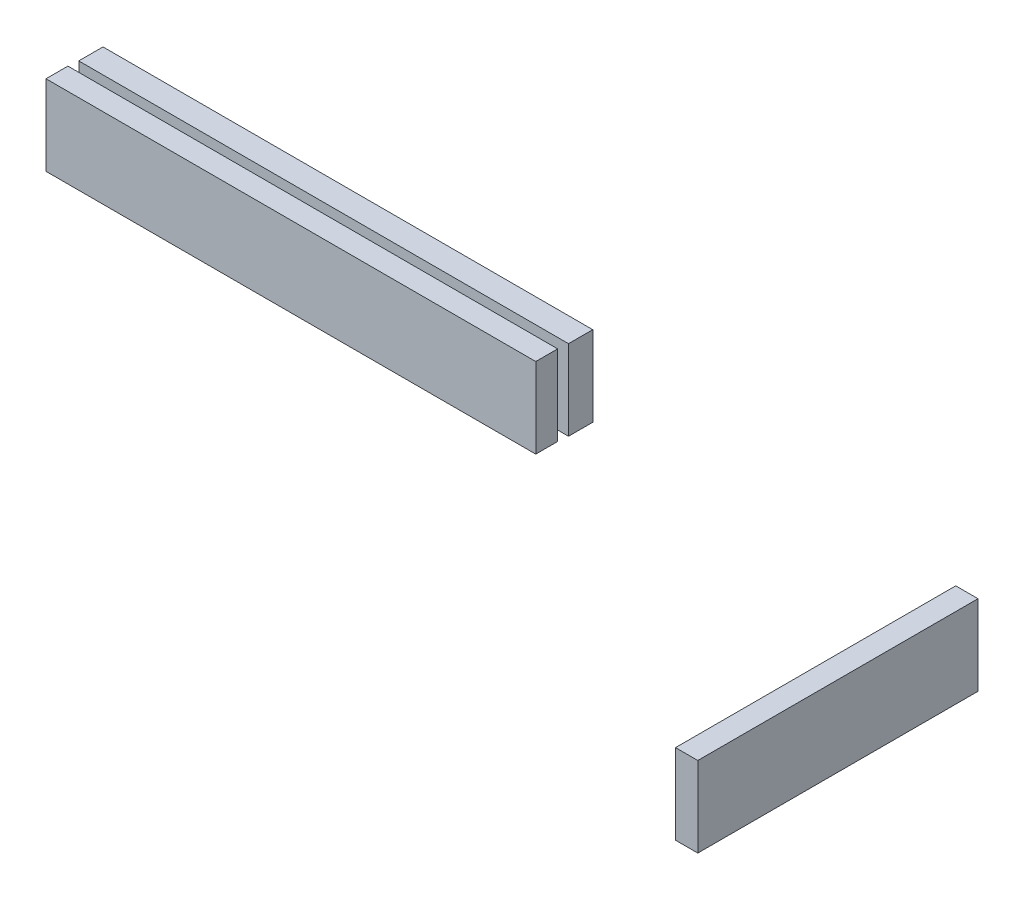
ISO-10303-21;
HEADER;
FILE_DESCRIPTION(('STEP AP214'),'2;1');
FILE_NAME('part.step','',(''),(''),'','','');
FILE_SCHEMA(('AUTOMOTIVE_DESIGN { 1 0 10303 214 1 1 1 1 }'));
ENDSEC;
DATA;
#1=APPLICATION_CONTEXT('core data for automotive mechanical design processes');
#2=APPLICATION_PROTOCOL_DEFINITION('international standard','automotive_design',2000,#1);
#3=PRODUCT_CONTEXT('',#1,'mechanical');
#4=PRODUCT('Part','Part','',(#3));
#5=PRODUCT_RELATED_PRODUCT_CATEGORY('part','',(#4));
#6=PRODUCT_DEFINITION_FORMATION('','',#4);
#7=PRODUCT_DEFINITION_CONTEXT('part definition',#1,'design');
#8=PRODUCT_DEFINITION('design','',#6,#7);
#9=PRODUCT_DEFINITION_SHAPE('','',#8);
#10=(LENGTH_UNIT() NAMED_UNIT(*) SI_UNIT(.MILLI.,.METRE.));
#11=(NAMED_UNIT(*) PLANE_ANGLE_UNIT() SI_UNIT($,.RADIAN.));
#12=(NAMED_UNIT(*) SI_UNIT($,.STERADIAN.) SOLID_ANGLE_UNIT());
#13=UNCERTAINTY_MEASURE_WITH_UNIT(LENGTH_MEASURE(1.E-05),#10,'distance_accuracy_value','');
#14=(GEOMETRIC_REPRESENTATION_CONTEXT(3) GLOBAL_UNCERTAINTY_ASSIGNED_CONTEXT((#13)) GLOBAL_UNIT_ASSIGNED_CONTEXT((#10,
#11,#12)) REPRESENTATION_CONTEXT('',''));
#15=CARTESIAN_POINT('',(0.,0.,0.));
#16=DIRECTION('',(0.,0.,1.));
#17=DIRECTION('',(1.,0.,0.));
#18=AXIS2_PLACEMENT_3D('',#15,#16,#17);
#19=CARTESIAN_POINT('',(76.2644648008081,10.,-11.147743928826));
#20=DIRECTION('',(0.,0.,1.));
#21=DIRECTION('',(1.,0.,0.));
#22=AXIS2_PLACEMENT_3D('',#19,#20,#21);
#23=PLANE('',#22);
#24=DIRECTION('',(-1.,0.,0.));
#25=VECTOR('',#24,1.);
#26=CARTESIAN_POINT('',(76.2644648008081,0.,-11.147743928826));
#27=LINE('',#26,#25);
#28=CARTESIAN_POINT('',(76.2644648008081,0.,-11.147743928826));
#29=VERTEX_POINT('',#28);
#30=CARTESIAN_POINT('',(73.4875714482769,0.,-11.147743928826));
#31=VERTEX_POINT('',#30);
#32=EDGE_CURVE('E12',#29,#31,#27,.T.);
#33=ORIENTED_EDGE('',*,*,#32,.T.);
#34=DIRECTION('',(0.,-1.,0.));
#35=VECTOR('',#34,1.);
#36=CARTESIAN_POINT('',(73.4875714482769,10.,-11.147743928826));
#37=LINE('',#36,#35);
#38=CARTESIAN_POINT('',(73.4875714482769,10.,-11.147743928826));
#39=VERTEX_POINT('',#38);
#40=EDGE_CURVE('E131',#39,#31,#37,.T.);
#41=ORIENTED_EDGE('',*,*,#40,.F.);
#42=DIRECTION('',(-1.,0.,0.));
#43=VECTOR('',#42,1.);
#44=CARTESIAN_POINT('',(76.2644648008081,10.,-11.147743928826));
#45=LINE('',#44,#43);
#46=CARTESIAN_POINT('',(76.2644648008081,10.,-11.147743928826));
#47=VERTEX_POINT('',#46);
#48=EDGE_CURVE('E62',#47,#39,#45,.T.);
#49=ORIENTED_EDGE('',*,*,#48,.F.);
#50=DIRECTION('',(0.,-1.,0.));
#51=VECTOR('',#50,1.);
#52=CARTESIAN_POINT('',(76.2644648008081,10.,-11.147743928826));
#53=LINE('',#52,#51);
#54=EDGE_CURVE('E117',#47,#29,#53,.T.);
#55=ORIENTED_EDGE('',*,*,#54,.T.);
#56=EDGE_LOOP('',(#33,#41,#49,#55));
#57=FACE_BOUND('',#56,.T.);
#58=ADVANCED_FACE('F58',(#57),#23,.F.);
#59=CARTESIAN_POINT('',(73.4875714482769,10.,23.7826514003821));
#60=DIRECTION('',(1.,0.,0.));
#61=DIRECTION('',(0.,0.,-1.));
#62=AXIS2_PLACEMENT_3D('',#59,#60,#61);
#63=PLANE('',#62);
#64=DIRECTION('',(0.,0.,1.));
#65=VECTOR('',#64,1.);
#66=CARTESIAN_POINT('',(73.4875714482769,0.,23.7826514003821));
#67=LINE('',#66,#65);
#68=CARTESIAN_POINT('',(73.4875714482769,0.,23.7826514003821));
#69=VERTEX_POINT('',#68);
#70=EDGE_CURVE('E68',#31,#69,#67,.T.);
#71=ORIENTED_EDGE('',*,*,#70,.T.);
#72=DIRECTION('',(0.,-1.,0.));
#73=VECTOR('',#72,1.);
#74=CARTESIAN_POINT('',(73.4875714482769,10.,23.7826514003821));
#75=LINE('',#74,#73);
#76=CARTESIAN_POINT('',(73.4875714482769,10.,23.7826514003821));
#77=VERTEX_POINT('',#76);
#78=EDGE_CURVE('E113',#77,#69,#75,.T.);
#79=ORIENTED_EDGE('',*,*,#78,.F.);
#80=DIRECTION('',(0.,0.,1.));
#81=VECTOR('',#80,1.);
#82=CARTESIAN_POINT('',(73.4875714482769,10.,23.7826514003821));
#83=LINE('',#82,#81);
#84=EDGE_CURVE('E92',#39,#77,#83,.T.);
#85=ORIENTED_EDGE('',*,*,#84,.F.);
#86=ORIENTED_EDGE('',*,*,#40,.T.);
#87=EDGE_LOOP('',(#71,#79,#85,#86));
#88=FACE_BOUND('',#87,.T.);
#89=ADVANCED_FACE('F134',(#88),#63,.F.);
#90=CARTESIAN_POINT('',(76.2644648008081,10.,23.7826514003821));
#91=DIRECTION('',(0.,0.,-1.));
#92=DIRECTION('',(-1.,0.,0.));
#93=AXIS2_PLACEMENT_3D('',#90,#91,#92);
#94=PLANE('',#93);
#95=DIRECTION('',(1.,0.,0.));
#96=VECTOR('',#95,1.);
#97=CARTESIAN_POINT('',(76.2644648008081,0.,23.7826514003821));
#98=LINE('',#97,#96);
#99=CARTESIAN_POINT('',(76.2644648008081,0.,23.7826514003821));
#100=VERTEX_POINT('',#99);
#101=EDGE_CURVE('E108',#69,#100,#98,.T.);
#102=ORIENTED_EDGE('',*,*,#101,.T.);
#103=DIRECTION('',(0.,-1.,0.));
#104=VECTOR('',#103,1.);
#105=CARTESIAN_POINT('',(76.2644648008081,10.,23.7826514003821));
#106=LINE('',#105,#104);
#107=CARTESIAN_POINT('',(76.2644648008081,10.,23.7826514003821));
#108=VERTEX_POINT('',#107);
#109=EDGE_CURVE('E111',#108,#100,#106,.T.);
#110=ORIENTED_EDGE('',*,*,#109,.F.);
#111=DIRECTION('',(1.,0.,0.));
#112=VECTOR('',#111,1.);
#113=CARTESIAN_POINT('',(76.2644648008081,10.,23.7826514003821));
#114=LINE('',#113,#112);
#115=EDGE_CURVE('E126',#77,#108,#114,.T.);
#116=ORIENTED_EDGE('',*,*,#115,.F.);
#117=ORIENTED_EDGE('',*,*,#78,.T.);
#118=EDGE_LOOP('',(#102,#110,#116,#117));
#119=FACE_BOUND('',#118,.T.);
#120=ADVANCED_FACE('F109',(#119),#94,.F.);
#121=CARTESIAN_POINT('',(76.2644648008081,10.,23.7826514003821));
#122=DIRECTION('',(-1.,0.,0.));
#123=DIRECTION('',(0.,0.,1.));
#124=AXIS2_PLACEMENT_3D('',#121,#122,#123);
#125=PLANE('',#124);
#126=DIRECTION('',(0.,0.,-1.));
#127=VECTOR('',#126,1.);
#128=CARTESIAN_POINT('',(76.2644648008081,0.,23.7826514003821));
#129=LINE('',#128,#127);
#130=EDGE_CURVE('E102',#100,#29,#129,.T.);
#131=ORIENTED_EDGE('',*,*,#130,.T.);
#132=ORIENTED_EDGE('',*,*,#54,.F.);
#133=DIRECTION('',(0.,0.,-1.));
#134=VECTOR('',#133,1.);
#135=CARTESIAN_POINT('',(76.2644648008081,10.,23.7826514003821));
#136=LINE('',#135,#134);
#137=EDGE_CURVE('E116',#108,#47,#136,.T.);
#138=ORIENTED_EDGE('',*,*,#137,.F.);
#139=ORIENTED_EDGE('',*,*,#109,.T.);
#140=EDGE_LOOP('',(#131,#132,#138,#139));
#141=FACE_BOUND('',#140,.T.);
#142=ADVANCED_FACE('F115',(#141),#125,.F.);
#143=CARTESIAN_POINT('',(0.,10.,0.));
#144=DIRECTION('',(0.,-1.,0.));
#145=DIRECTION('',(0.,0.,-1.));
#146=AXIS2_PLACEMENT_3D('',#143,#144,#145);
#147=PLANE('',#146);
#148=ORIENTED_EDGE('',*,*,#48,.T.);
#149=ORIENTED_EDGE('',*,*,#84,.T.);
#150=ORIENTED_EDGE('',*,*,#115,.T.);
#151=ORIENTED_EDGE('',*,*,#137,.T.);
#152=EDGE_LOOP('',(#148,#149,#150,#151));
#153=FACE_BOUND('',#152,.T.);
#154=ADVANCED_FACE('F60',(#153),#147,.F.);
#155=CARTESIAN_POINT('',(0.,0.,0.));
#156=DIRECTION('',(0.,-1.,0.));
#157=DIRECTION('',(0.,0.,-1.));
#158=AXIS2_PLACEMENT_3D('',#155,#156,#157);
#159=PLANE('',#158);
#160=ORIENTED_EDGE('',*,*,#32,.F.);
#161=ORIENTED_EDGE('',*,*,#130,.F.);
#162=ORIENTED_EDGE('',*,*,#101,.F.);
#163=ORIENTED_EDGE('',*,*,#70,.F.);
#164=EDGE_LOOP('',(#160,#161,#162,#163));
#165=FACE_BOUND('',#164,.T.);
#166=ADVANCED_FACE('F119',(#165),#159,.T.);
#167=CLOSED_SHELL('',(#58,#89,#120,#142,#154,#166));
#168=MANIFOLD_SOLID_BREP('B2',#167);
#169=CARTESIAN_POINT('',(23.207246349694,10.,-13.1574072251681));
#170=DIRECTION('',(-1.,0.,0.));
#171=DIRECTION('',(0.,0.,1.));
#172=AXIS2_PLACEMENT_3D('',#169,#170,#171);
#173=PLANE('',#172);
#174=DIRECTION('',(0.,0.,-1.));
#175=VECTOR('',#174,1.);
#176=CARTESIAN_POINT('',(23.207246349694,0.,-13.1574072251681));
#177=LINE('',#176,#175);
#178=CARTESIAN_POINT('',(23.207246349694,0.,-13.1574072251681));
#179=VERTEX_POINT('',#178);
#180=CARTESIAN_POINT('',(23.207246349694,0.,-16.1798549779529));
#181=VERTEX_POINT('',#180);
#182=EDGE_CURVE('E56',#179,#181,#177,.T.);
#183=ORIENTED_EDGE('',*,*,#182,.T.);
#184=DIRECTION('',(0.,-1.,0.));
#185=VECTOR('',#184,1.);
#186=CARTESIAN_POINT('',(23.207246349694,10.,-16.1798549779529));
#187=LINE('',#186,#185);
#188=CARTESIAN_POINT('',(23.207246349694,10.,-16.1798549779529));
#189=VERTEX_POINT('',#188);
#190=EDGE_CURVE('E273',#189,#181,#187,.T.);
#191=ORIENTED_EDGE('',*,*,#190,.F.);
#192=DIRECTION('',(0.,0.,-1.));
#193=VECTOR('',#192,1.);
#194=CARTESIAN_POINT('',(23.207246349694,10.,-13.1574072251681));
#195=LINE('',#194,#193);
#196=CARTESIAN_POINT('',(23.207246349694,10.,-13.1574072251681));
#197=VERTEX_POINT('',#196);
#198=EDGE_CURVE('E197',#197,#189,#195,.T.);
#199=ORIENTED_EDGE('',*,*,#198,.F.);
#200=DIRECTION('',(0.,-1.,0.));
#201=VECTOR('',#200,1.);
#202=CARTESIAN_POINT('',(23.207246349694,10.,-13.1574072251681));
#203=LINE('',#202,#201);
#204=EDGE_CURVE('E255',#197,#179,#203,.T.);
#205=ORIENTED_EDGE('',*,*,#204,.T.);
#206=EDGE_LOOP('',(#183,#191,#199,#205));
#207=FACE_BOUND('',#206,.T.);
#208=ADVANCED_FACE('F193',(#207),#173,.F.);
#209=CARTESIAN_POINT('',(-37.8461982565598,10.,-16.1798549779529));
#210=DIRECTION('',(0.,0.,1.));
#211=DIRECTION('',(1.,0.,0.));
#212=AXIS2_PLACEMENT_3D('',#209,#210,#211);
#213=PLANE('',#212);
#214=DIRECTION('',(-1.,0.,0.));
#215=VECTOR('',#214,1.);
#216=CARTESIAN_POINT('',(-37.8461982565598,0.,-16.1798549779529));
#217=LINE('',#216,#215);
#218=CARTESIAN_POINT('',(-37.8461982565598,0.,-16.1798549779529));
#219=VERTEX_POINT('',#218);
#220=EDGE_CURVE('E204',#181,#219,#217,.T.);
#221=ORIENTED_EDGE('',*,*,#220,.T.);
#222=DIRECTION('',(0.,-1.,0.));
#223=VECTOR('',#222,1.);
#224=CARTESIAN_POINT('',(-37.8461982565598,10.,-16.1798549779529));
#225=LINE('',#224,#223);
#226=CARTESIAN_POINT('',(-37.8461982565598,10.,-16.1798549779529));
#227=VERTEX_POINT('',#226);
#228=EDGE_CURVE('E249',#227,#219,#225,.T.);
#229=ORIENTED_EDGE('',*,*,#228,.F.);
#230=DIRECTION('',(-1.,0.,0.));
#231=VECTOR('',#230,1.);
#232=CARTESIAN_POINT('',(-37.8461982565598,10.,-16.1798549779529));
#233=LINE('',#232,#231);
#234=EDGE_CURVE('E228',#189,#227,#233,.T.);
#235=ORIENTED_EDGE('',*,*,#234,.F.);
#236=ORIENTED_EDGE('',*,*,#190,.T.);
#237=EDGE_LOOP('',(#221,#229,#235,#236));
#238=FACE_BOUND('',#237,.T.);
#239=ADVANCED_FACE('F277',(#238),#213,.F.);
#240=CARTESIAN_POINT('',(-37.8461982565598,10.,-13.1574072251681));
#241=DIRECTION('',(1.,0.,0.));
#242=DIRECTION('',(0.,0.,-1.));
#243=AXIS2_PLACEMENT_3D('',#240,#241,#242);
#244=PLANE('',#243);
#245=DIRECTION('',(0.,0.,1.));
#246=VECTOR('',#245,1.);
#247=CARTESIAN_POINT('',(-37.8461982565598,0.,-13.1574072251681));
#248=LINE('',#247,#246);
#249=CARTESIAN_POINT('',(-37.8461982565598,0.,-13.1574072251681));
#250=VERTEX_POINT('',#249);
#251=EDGE_CURVE('E244',#219,#250,#248,.T.);
#252=ORIENTED_EDGE('',*,*,#251,.T.);
#253=DIRECTION('',(0.,-1.,0.));
#254=VECTOR('',#253,1.);
#255=CARTESIAN_POINT('',(-37.8461982565598,10.,-13.1574072251681));
#256=LINE('',#255,#254);
#257=CARTESIAN_POINT('',(-37.8461982565598,10.,-13.1574072251681));
#258=VERTEX_POINT('',#257);
#259=EDGE_CURVE('E247',#258,#250,#256,.T.);
#260=ORIENTED_EDGE('',*,*,#259,.F.);
#261=DIRECTION('',(0.,0.,1.));
#262=VECTOR('',#261,1.);
#263=CARTESIAN_POINT('',(-37.8461982565598,10.,-13.1574072251681));
#264=LINE('',#263,#262);
#265=EDGE_CURVE('E267',#227,#258,#264,.T.);
#266=ORIENTED_EDGE('',*,*,#265,.F.);
#267=ORIENTED_EDGE('',*,*,#228,.T.);
#268=EDGE_LOOP('',(#252,#260,#266,#267));
#269=FACE_BOUND('',#268,.T.);
#270=ADVANCED_FACE('F245',(#269),#244,.F.);
#271=CARTESIAN_POINT('',(-37.8461982565598,10.,-13.1574072251681));
#272=DIRECTION('',(0.,0.,-1.));
#273=DIRECTION('',(-1.,0.,0.));
#274=AXIS2_PLACEMENT_3D('',#271,#272,#273);
#275=PLANE('',#274);
#276=DIRECTION('',(1.,0.,0.));
#277=VECTOR('',#276,1.);
#278=CARTESIAN_POINT('',(-37.8461982565598,0.,-13.1574072251681));
#279=LINE('',#278,#277);
#280=EDGE_CURVE('E238',#250,#179,#279,.T.);
#281=ORIENTED_EDGE('',*,*,#280,.T.);
#282=ORIENTED_EDGE('',*,*,#204,.F.);
#283=DIRECTION('',(1.,0.,0.));
#284=VECTOR('',#283,1.);
#285=CARTESIAN_POINT('',(-37.8461982565598,10.,-13.1574072251681));
#286=LINE('',#285,#284);
#287=EDGE_CURVE('E253',#258,#197,#286,.T.);
#288=ORIENTED_EDGE('',*,*,#287,.F.);
#289=ORIENTED_EDGE('',*,*,#259,.T.);
#290=EDGE_LOOP('',(#281,#282,#288,#289));
#291=FACE_BOUND('',#290,.T.);
#292=ADVANCED_FACE('F252',(#291),#275,.F.);
#293=CARTESIAN_POINT('',(0.,10.,0.));
#294=DIRECTION('',(0.,-1.,0.));
#295=DIRECTION('',(0.,0.,-1.));
#296=AXIS2_PLACEMENT_3D('',#293,#294,#295);
#297=PLANE('',#296);
#298=ORIENTED_EDGE('',*,*,#198,.T.);
#299=ORIENTED_EDGE('',*,*,#234,.T.);
#300=ORIENTED_EDGE('',*,*,#265,.T.);
#301=ORIENTED_EDGE('',*,*,#287,.T.);
#302=EDGE_LOOP('',(#298,#299,#300,#301));
#303=FACE_BOUND('',#302,.T.);
#304=ADVANCED_FACE('F195',(#303),#297,.F.);
#305=CARTESIAN_POINT('',(0.,0.,0.));
#306=DIRECTION('',(0.,-1.,0.));
#307=DIRECTION('',(0.,0.,-1.));
#308=AXIS2_PLACEMENT_3D('',#305,#306,#307);
#309=PLANE('',#308);
#310=ORIENTED_EDGE('',*,*,#182,.F.);
#311=ORIENTED_EDGE('',*,*,#280,.F.);
#312=ORIENTED_EDGE('',*,*,#251,.F.);
#313=ORIENTED_EDGE('',*,*,#220,.F.);
#314=EDGE_LOOP('',(#310,#311,#312,#313));
#315=FACE_BOUND('',#314,.T.);
#316=ADVANCED_FACE('F257',(#315),#309,.T.);
#317=CLOSED_SHELL('',(#208,#239,#270,#292,#304,#316));
#318=MANIFOLD_SOLID_BREP('B6',#317);
#319=CARTESIAN_POINT('',(23.0935164604766,10.,-9.18797560105169));
#320=DIRECTION('',(-1.,0.,0.));
#321=DIRECTION('',(0.,0.,1.));
#322=AXIS2_PLACEMENT_3D('',#319,#320,#321);
#323=PLANE('',#322);
#324=DIRECTION('',(0.,0.,-1.));
#325=VECTOR('',#324,1.);
#326=CARTESIAN_POINT('',(23.0935164604766,0.,-9.18797560105169));
#327=LINE('',#326,#325);
#328=CARTESIAN_POINT('',(23.0935164604766,0.,-9.18797560105169));
#329=VERTEX_POINT('',#328);
#330=CARTESIAN_POINT('',(23.0935164604766,0.,-11.9197039252506));
#331=VERTEX_POINT('',#330);
#332=EDGE_CURVE('E392',#329,#331,#327,.T.);
#333=ORIENTED_EDGE('',*,*,#332,.T.);
#334=DIRECTION('',(0.,-1.,0.));
#335=VECTOR('',#334,1.);
#336=CARTESIAN_POINT('',(23.0935164604766,10.,-11.9197039252506));
#337=LINE('',#336,#335);
#338=CARTESIAN_POINT('',(23.0935164604766,10.,-11.9197039252506));
#339=VERTEX_POINT('',#338);
#340=EDGE_CURVE('E191',#339,#331,#337,.T.);
#341=ORIENTED_EDGE('',*,*,#340,.F.);
#342=DIRECTION('',(0.,0.,-1.));
#343=VECTOR('',#342,1.);
#344=CARTESIAN_POINT('',(23.0935164604766,10.,-9.18797560105169));
#345=LINE('',#344,#343);
#346=CARTESIAN_POINT('',(23.0935164604766,10.,-9.18797560105169));
#347=VERTEX_POINT('',#346);
#348=EDGE_CURVE('E380',#347,#339,#345,.T.);
#349=ORIENTED_EDGE('',*,*,#348,.F.);
#350=DIRECTION('',(0.,-1.,0.));
#351=VECTOR('',#350,1.);
#352=CARTESIAN_POINT('',(23.0935164604766,10.,-9.18797560105169));
#353=LINE('',#352,#351);
#354=EDGE_CURVE('E388',#347,#329,#353,.T.);
#355=ORIENTED_EDGE('',*,*,#354,.T.);
#356=EDGE_LOOP('',(#333,#341,#349,#355));
#357=FACE_BOUND('',#356,.T.);
#358=ADVANCED_FACE('F329',(#357),#323,.F.);
#359=CARTESIAN_POINT('',(-37.9599281457769,10.,-11.9197039252506));
#360=DIRECTION('',(0.,0.,1.));
#361=DIRECTION('',(1.,0.,0.));
#362=AXIS2_PLACEMENT_3D('',#359,#360,#361);
#363=PLANE('',#362);
#364=DIRECTION('',(-1.,0.,0.));
#365=VECTOR('',#364,1.);
#366=CARTESIAN_POINT('',(-37.9599281457769,0.,-11.9197039252506));
#367=LINE('',#366,#365);
#368=CARTESIAN_POINT('',(-37.9599281457769,0.,-11.9197039252506));
#369=VERTEX_POINT('',#368);
#370=EDGE_CURVE('E384',#331,#369,#367,.T.);
#371=ORIENTED_EDGE('',*,*,#370,.T.);
#372=DIRECTION('',(0.,-1.,0.));
#373=VECTOR('',#372,1.);
#374=CARTESIAN_POINT('',(-37.9599281457769,10.,-11.9197039252506));
#375=LINE('',#374,#373);
#376=CARTESIAN_POINT('',(-37.9599281457769,10.,-11.9197039252506));
#377=VERTEX_POINT('',#376);
#378=EDGE_CURVE('E337',#377,#369,#375,.T.);
#379=ORIENTED_EDGE('',*,*,#378,.F.);
#380=DIRECTION('',(-1.,0.,0.));
#381=VECTOR('',#380,1.);
#382=CARTESIAN_POINT('',(-37.9599281457769,10.,-11.9197039252506));
#383=LINE('',#382,#381);
#384=EDGE_CURVE('E375',#339,#377,#383,.T.);
#385=ORIENTED_EDGE('',*,*,#384,.F.);
#386=ORIENTED_EDGE('',*,*,#340,.T.);
#387=EDGE_LOOP('',(#371,#379,#385,#386));
#388=FACE_BOUND('',#387,.T.);
#389=ADVANCED_FACE('F383',(#388),#363,.F.);
#390=CARTESIAN_POINT('',(-37.9599281457769,10.,-9.18797560105169));
#391=DIRECTION('',(1.,0.,0.));
#392=DIRECTION('',(0.,0.,-1.));
#393=AXIS2_PLACEMENT_3D('',#390,#391,#392);
#394=PLANE('',#393);
#395=DIRECTION('',(0.,0.,1.));
#396=VECTOR('',#395,1.);
#397=CARTESIAN_POINT('',(-37.9599281457769,0.,-9.18797560105169));
#398=LINE('',#397,#396);
#399=CARTESIAN_POINT('',(-37.9599281457769,0.,-9.18797560105169));
#400=VERTEX_POINT('',#399);
#401=EDGE_CURVE('E362',#369,#400,#398,.T.);
#402=ORIENTED_EDGE('',*,*,#401,.T.);
#403=DIRECTION('',(0.,-1.,0.));
#404=VECTOR('',#403,1.);
#405=CARTESIAN_POINT('',(-37.9599281457769,10.,-9.18797560105169));
#406=LINE('',#405,#404);
#407=CARTESIAN_POINT('',(-37.9599281457769,10.,-9.18797560105169));
#408=VERTEX_POINT('',#407);
#409=EDGE_CURVE('E385',#408,#400,#406,.T.);
#410=ORIENTED_EDGE('',*,*,#409,.F.);
#411=DIRECTION('',(0.,0.,1.));
#412=VECTOR('',#411,1.);
#413=CARTESIAN_POINT('',(-37.9599281457769,10.,-9.18797560105169));
#414=LINE('',#413,#412);
#415=EDGE_CURVE('E378',#377,#408,#414,.T.);
#416=ORIENTED_EDGE('',*,*,#415,.F.);
#417=ORIENTED_EDGE('',*,*,#378,.T.);
#418=EDGE_LOOP('',(#402,#410,#416,#417));
#419=FACE_BOUND('',#418,.T.);
#420=ADVANCED_FACE('F386',(#419),#394,.F.);
#421=CARTESIAN_POINT('',(-37.9599281457769,10.,-9.18797560105169));
#422=DIRECTION('',(0.,0.,-1.));
#423=DIRECTION('',(-1.,0.,0.));
#424=AXIS2_PLACEMENT_3D('',#421,#422,#423);
#425=PLANE('',#424);
#426=DIRECTION('',(1.,0.,0.));
#427=VECTOR('',#426,1.);
#428=CARTESIAN_POINT('',(-37.9599281457769,0.,-9.18797560105169));
#429=LINE('',#428,#427);
#430=EDGE_CURVE('E368',#400,#329,#429,.T.);
#431=ORIENTED_EDGE('',*,*,#430,.T.);
#432=ORIENTED_EDGE('',*,*,#354,.F.);
#433=DIRECTION('',(1.,0.,0.));
#434=VECTOR('',#433,1.);
#435=CARTESIAN_POINT('',(-37.9599281457769,10.,-9.18797560105169));
#436=LINE('',#435,#434);
#437=EDGE_CURVE('E345',#408,#347,#436,.T.);
#438=ORIENTED_EDGE('',*,*,#437,.F.);
#439=ORIENTED_EDGE('',*,*,#409,.T.);
#440=EDGE_LOOP('',(#431,#432,#438,#439));
#441=FACE_BOUND('',#440,.T.);
#442=ADVANCED_FACE('F399',(#441),#425,.F.);
#443=CARTESIAN_POINT('',(0.,10.,0.));
#444=DIRECTION('',(0.,-1.,0.));
#445=DIRECTION('',(0.,0.,-1.));
#446=AXIS2_PLACEMENT_3D('',#443,#444,#445);
#447=PLANE('',#446);
#448=ORIENTED_EDGE('',*,*,#348,.T.);
#449=ORIENTED_EDGE('',*,*,#384,.T.);
#450=ORIENTED_EDGE('',*,*,#415,.T.);
#451=ORIENTED_EDGE('',*,*,#437,.T.);
#452=EDGE_LOOP('',(#448,#449,#450,#451));
#453=FACE_BOUND('',#452,.T.);
#454=ADVANCED_FACE('F376',(#453),#447,.F.);
#455=CARTESIAN_POINT('',(0.,0.,0.));
#456=DIRECTION('',(0.,-1.,0.));
#457=DIRECTION('',(0.,0.,-1.));
#458=AXIS2_PLACEMENT_3D('',#455,#456,#457);
#459=PLANE('',#458);
#460=ORIENTED_EDGE('',*,*,#332,.F.);
#461=ORIENTED_EDGE('',*,*,#430,.F.);
#462=ORIENTED_EDGE('',*,*,#401,.F.);
#463=ORIENTED_EDGE('',*,*,#370,.F.);
#464=EDGE_LOOP('',(#460,#461,#462,#463));
#465=FACE_BOUND('',#464,.T.);
#466=ADVANCED_FACE('F402',(#465),#459,.T.);
#467=CLOSED_SHELL('',(#358,#389,#420,#442,#454,#466));
#468=MANIFOLD_SOLID_BREP('B50',#467);
#469=ADVANCED_BREP_SHAPE_REPRESENTATION('',(#18,#168,#318,#468),#14);
#470=SHAPE_DEFINITION_REPRESENTATION(#9,#469);
ENDSEC;
END-ISO-10303-21;
